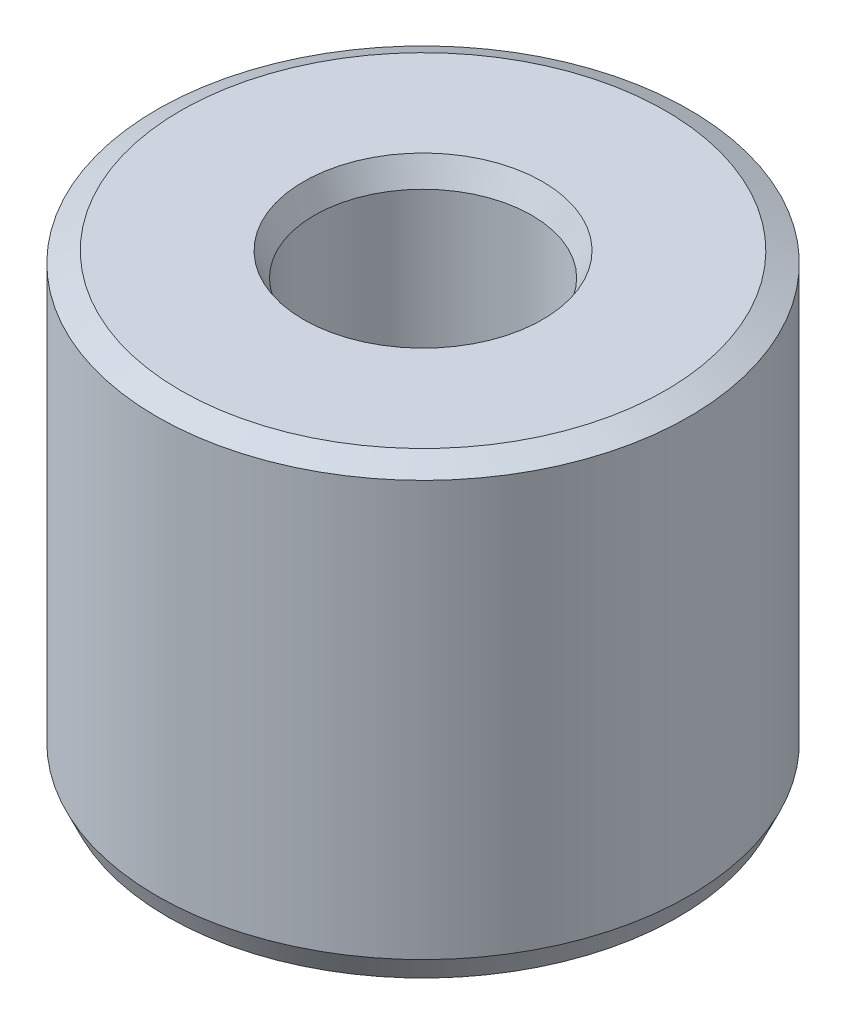
ISO-10303-21;
HEADER;
FILE_DESCRIPTION(('STEP AP214'),'2;1');
FILE_NAME('part.step','',(''),(''),'','','');
FILE_SCHEMA(('AUTOMOTIVE_DESIGN { 1 0 10303 214 1 1 1 1 }'));
ENDSEC;
DATA;
#1=APPLICATION_CONTEXT('core data for automotive mechanical design processes');
#2=APPLICATION_PROTOCOL_DEFINITION('international standard','automotive_design',2000,#1);
#3=PRODUCT_CONTEXT('',#1,'mechanical');
#4=PRODUCT('Part','Part','',(#3));
#5=PRODUCT_RELATED_PRODUCT_CATEGORY('part','',(#4));
#6=PRODUCT_DEFINITION_FORMATION('','',#4);
#7=PRODUCT_DEFINITION_CONTEXT('part definition',#1,'design');
#8=PRODUCT_DEFINITION('design','',#6,#7);
#9=PRODUCT_DEFINITION_SHAPE('','',#8);
#10=(LENGTH_UNIT() NAMED_UNIT(*) SI_UNIT(.MILLI.,.METRE.));
#11=(NAMED_UNIT(*) PLANE_ANGLE_UNIT() SI_UNIT($,.RADIAN.));
#12=(NAMED_UNIT(*) SI_UNIT($,.STERADIAN.) SOLID_ANGLE_UNIT());
#13=UNCERTAINTY_MEASURE_WITH_UNIT(LENGTH_MEASURE(1.E-05),#10,'distance_accuracy_value','');
#14=(GEOMETRIC_REPRESENTATION_CONTEXT(3) GLOBAL_UNCERTAINTY_ASSIGNED_CONTEXT((#13)) GLOBAL_UNIT_ASSIGNED_CONTEXT((#10,
#11,#12)) REPRESENTATION_CONTEXT('',''));
#15=CARTESIAN_POINT('',(0.,0.,0.));
#16=DIRECTION('',(0.,0.,1.));
#17=DIRECTION('',(1.,0.,0.));
#18=AXIS2_PLACEMENT_3D('',#15,#16,#17);
#19=CARTESIAN_POINT('',(0.,46.4651237568161,0.));
#20=DIRECTION('',(0.,-1.,0.));
#21=DIRECTION('',(0.,0.,-1.));
#22=AXIS2_PLACEMENT_3D('',#19,#20,#21);
#23=CYLINDRICAL_SURFACE('',#22,27.5);
#24=CARTESIAN_POINT('',(0.,2.44746969285053,0.));
#25=DIRECTION('',(0.,1.,0.));
#26=DIRECTION('',(0.,0.,1.));
#27=AXIS2_PLACEMENT_3D('',#24,#25,#26);
#28=CIRCLE('',#27,27.5);
#29=CARTESIAN_POINT('',(0.,2.44746969285053,27.5));
#30=VERTEX_POINT('',#29);
#31=EDGE_CURVE('E10',#30,#30,#28,.T.);
#32=ORIENTED_EDGE('',*,*,#31,.T.);
#33=EDGE_LOOP('',(#32));
#34=FACE_BOUND('',#33,.T.);
#35=CARTESIAN_POINT('',(0.,45.339250293534,0.));
#36=DIRECTION('',(0.,1.,0.));
#37=DIRECTION('',(0.,0.,1.));
#38=AXIS2_PLACEMENT_3D('',#35,#36,#37);
#39=CIRCLE('',#38,27.5);
#40=CARTESIAN_POINT('',(0.,45.339250293534,27.5));
#41=VERTEX_POINT('',#40);
#42=EDGE_CURVE('E50',#41,#41,#39,.F.);
#43=ORIENTED_EDGE('',*,*,#42,.T.);
#44=EDGE_LOOP('',(#43));
#45=FACE_BOUND('',#44,.T.);
#46=ADVANCED_FACE('F39',(#34,#45),#23,.T.);
#47=CARTESIAN_POINT('',(0.,46.4651237568161,0.));
#48=DIRECTION('',(0.,1.,0.));
#49=DIRECTION('',(0.,0.,1.));
#50=AXIS2_PLACEMENT_3D('',#47,#48,#49);
#51=PLANE('',#50);
#52=CARTESIAN_POINT('',(0.,46.4651237568161,0.));
#53=DIRECTION('',(0.,1.,0.));
#54=DIRECTION('',(0.,0.,1.));
#55=AXIS2_PLACEMENT_3D('',#52,#53,#54);
#56=CIRCLE('',#55,12.3537882480915);
#57=CARTESIAN_POINT('',(0.,46.4651237568161,12.3537882480915));
#58=VERTEX_POINT('',#57);
#59=EDGE_CURVE('E58',#58,#58,#56,.F.);
#60=ORIENTED_EDGE('',*,*,#59,.T.);
#61=EDGE_LOOP('',(#60));
#62=FACE_BOUND('',#61,.T.);
#63=CARTESIAN_POINT('',(0.,46.4651237568161,0.));
#64=DIRECTION('',(0.,1.,0.));
#65=DIRECTION('',(0.,0.,1.));
#66=AXIS2_PLACEMENT_3D('',#63,#64,#65);
#67=CIRCLE('',#66,25.0525303071495);
#68=CARTESIAN_POINT('',(0.,46.4651237568161,25.0525303071495));
#69=VERTEX_POINT('',#68);
#70=EDGE_CURVE('E61',#69,#69,#67,.T.);
#71=ORIENTED_EDGE('',*,*,#70,.T.);
#72=EDGE_LOOP('',(#71));
#73=FACE_BOUND('',#72,.T.);
#74=ADVANCED_FACE('F88',(#62,#73),#51,.T.);
#75=CARTESIAN_POINT('',(0.,0.,0.));
#76=DIRECTION('',(0.,1.,0.));
#77=DIRECTION('',(0.,0.,1.));
#78=AXIS2_PLACEMENT_3D('',#75,#76,#77);
#79=PLANE('',#78);
#80=CARTESIAN_POINT('',(0.,0.,0.));
#81=DIRECTION('',(0.,1.,0.));
#82=DIRECTION('',(0.,0.,1.));
#83=AXIS2_PLACEMENT_3D('',#80,#81,#82);
#84=CIRCLE('',#83,13.6753844776599);
#85=CARTESIAN_POINT('',(0.,0.,13.6753844776599));
#86=VERTEX_POINT('',#85);
#87=EDGE_CURVE('E51',#86,#86,#84,.T.);
#88=ORIENTED_EDGE('',*,*,#87,.T.);
#89=EDGE_LOOP('',(#88));
#90=FACE_BOUND('',#89,.T.);
#91=CARTESIAN_POINT('',(0.,0.,0.));
#92=DIRECTION('',(0.,1.,0.));
#93=DIRECTION('',(0.,0.,1.));
#94=AXIS2_PLACEMENT_3D('',#91,#92,#93);
#95=CIRCLE('',#94,26.3741265367179);
#96=CARTESIAN_POINT('',(0.,0.,26.3741265367179));
#97=VERTEX_POINT('',#96);
#98=EDGE_CURVE('E54',#97,#97,#95,.F.);
#99=ORIENTED_EDGE('',*,*,#98,.T.);
#100=EDGE_LOOP('',(#99));
#101=FACE_BOUND('',#100,.T.);
#102=ADVANCED_FACE('F83',(#90,#101),#79,.F.);
#103=CARTESIAN_POINT('',(0.,46.4651237568161,0.));
#104=DIRECTION('',(0.,-1.,0.));
#105=DIRECTION('',(0.,0.,-1.));
#106=AXIS2_PLACEMENT_3D('',#103,#104,#105);
#107=CYLINDRICAL_SURFACE('',#106,11.2279147848094);
#108=CARTESIAN_POINT('',(0.,44.0176540639656,0.));
#109=DIRECTION('',(0.,1.,0.));
#110=DIRECTION('',(0.,0.,1.));
#111=AXIS2_PLACEMENT_3D('',#108,#109,#110);
#112=CIRCLE('',#111,11.2279147848094);
#113=CARTESIAN_POINT('',(0.,44.0176540639656,11.2279147848094));
#114=VERTEX_POINT('',#113);
#115=EDGE_CURVE('E67',#114,#114,#112,.T.);
#116=ORIENTED_EDGE('',*,*,#115,.T.);
#117=EDGE_LOOP('',(#116));
#118=FACE_BOUND('',#117,.T.);
#119=CARTESIAN_POINT('',(0.,1.12587346328207,0.));
#120=DIRECTION('',(0.,1.,0.));
#121=DIRECTION('',(0.,0.,1.));
#122=AXIS2_PLACEMENT_3D('',#119,#120,#121);
#123=CIRCLE('',#122,11.2279147848094);
#124=CARTESIAN_POINT('',(0.,1.12587346328207,11.2279147848094));
#125=VERTEX_POINT('',#124);
#126=EDGE_CURVE('E69',#125,#125,#123,.F.);
#127=ORIENTED_EDGE('',*,*,#126,.T.);
#128=EDGE_LOOP('',(#127));
#129=FACE_BOUND('',#128,.T.);
#130=ADVANCED_FACE('F71',(#118,#129),#107,.F.);
#131=CARTESIAN_POINT('',(0.,44.0176540639656,0.));
#132=DIRECTION('',(0.,1.,0.));
#133=DIRECTION('',(0.,0.,1.));
#134=AXIS2_PLACEMENT_3D('',#131,#132,#133);
#135=CONICAL_SURFACE('',#134,11.2279147848094,0.43115135450799);
#136=ORIENTED_EDGE('',*,*,#59,.F.);
#137=EDGE_LOOP('',(#136));
#138=FACE_BOUND('',#137,.T.);
#139=ORIENTED_EDGE('',*,*,#115,.F.);
#140=EDGE_LOOP('',(#139));
#141=FACE_BOUND('',#140,.T.);
#142=ADVANCED_FACE('F77',(#138,#141),#135,.F.);
#143=CARTESIAN_POINT('',(0.,0.,0.));
#144=DIRECTION('',(0.,-1.,0.));
#145=DIRECTION('',(0.,0.,-1.));
#146=AXIS2_PLACEMENT_3D('',#143,#144,#145);
#147=CONICAL_SURFACE('',#146,13.6753844776599,1.13964497228691);
#148=ORIENTED_EDGE('',*,*,#126,.F.);
#149=EDGE_LOOP('',(#148));
#150=FACE_BOUND('',#149,.T.);
#151=ORIENTED_EDGE('',*,*,#87,.F.);
#152=EDGE_LOOP('',(#151));
#153=FACE_BOUND('',#152,.T.);
#154=ADVANCED_FACE('F73',(#150,#153),#147,.F.);
#155=CARTESIAN_POINT('',(0.,2.44746969285053,0.));
#156=DIRECTION('',(0.,1.,0.));
#157=DIRECTION('',(0.,0.,1.));
#158=AXIS2_PLACEMENT_3D('',#155,#156,#157);
#159=CONICAL_SURFACE('',#158,27.5,0.431151354507987);
#160=ORIENTED_EDGE('',*,*,#98,.F.);
#161=EDGE_LOOP('',(#160));
#162=FACE_BOUND('',#161,.T.);
#163=ORIENTED_EDGE('',*,*,#31,.F.);
#164=EDGE_LOOP('',(#163));
#165=FACE_BOUND('',#164,.T.);
#166=ADVANCED_FACE('F76',(#162,#165),#159,.T.);
#167=CARTESIAN_POINT('',(0.,46.4651237568161,0.));
#168=DIRECTION('',(0.,-1.,0.));
#169=DIRECTION('',(0.,0.,-1.));
#170=AXIS2_PLACEMENT_3D('',#167,#168,#169);
#171=CONICAL_SURFACE('',#170,25.0525303071495,1.13964497228691);
#172=ORIENTED_EDGE('',*,*,#42,.F.);
#173=EDGE_LOOP('',(#172));
#174=FACE_BOUND('',#173,.T.);
#175=ORIENTED_EDGE('',*,*,#70,.F.);
#176=EDGE_LOOP('',(#175));
#177=FACE_BOUND('',#176,.T.);
#178=ADVANCED_FACE('F45',(#174,#177),#171,.T.);
#179=CLOSED_SHELL('',(#46,#74,#102,#130,#142,#154,#166,#178));
#180=MANIFOLD_SOLID_BREP('B2',#179);
#181=ADVANCED_BREP_SHAPE_REPRESENTATION('',(#18,#180),#14);
#182=SHAPE_DEFINITION_REPRESENTATION(#9,#181);
ENDSEC;
END-ISO-10303-21;
